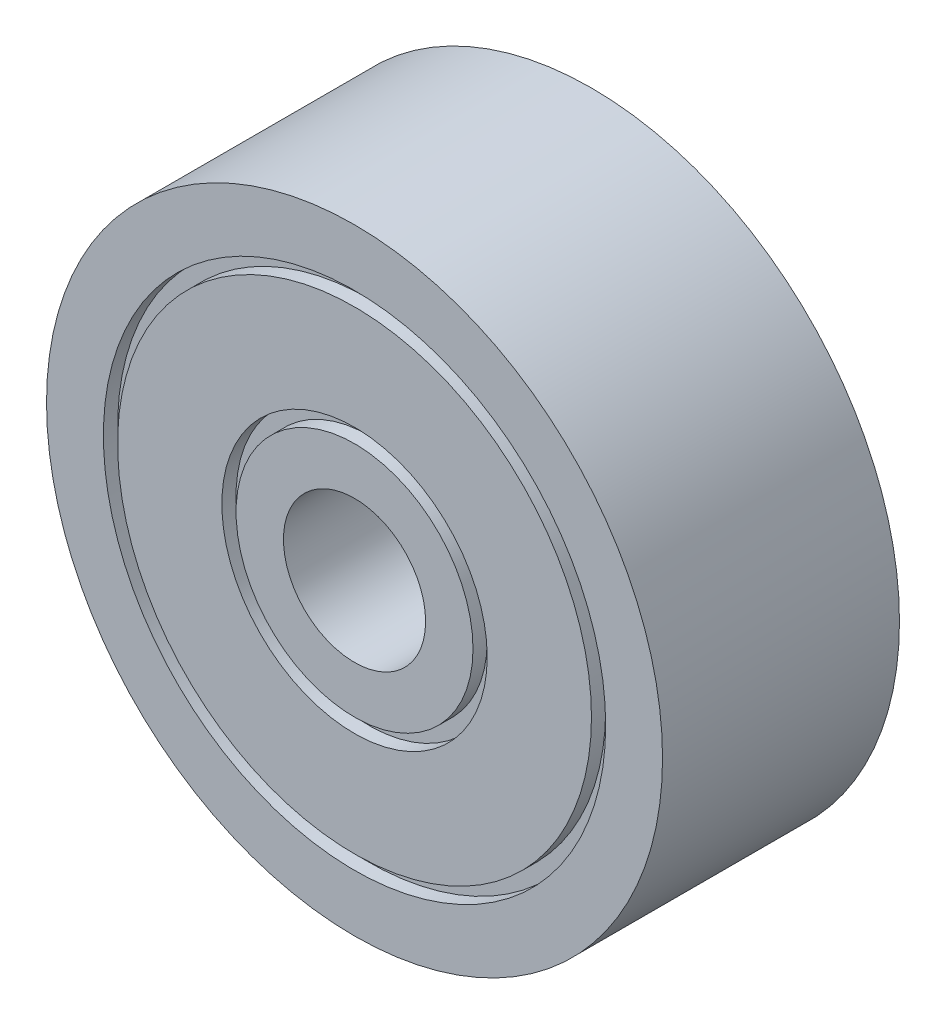
ISO-10303-21;
HEADER;
FILE_DESCRIPTION(('STEP AP214'),'2;1');
FILE_NAME('part.step','',(''),(''),'','','');
FILE_SCHEMA(('AUTOMOTIVE_DESIGN { 1 0 10303 214 1 1 1 1 }'));
ENDSEC;
DATA;
#1=APPLICATION_CONTEXT('core data for automotive mechanical design processes');
#2=APPLICATION_PROTOCOL_DEFINITION('international standard','automotive_design',2000,#1);
#3=PRODUCT_CONTEXT('',#1,'mechanical');
#4=PRODUCT('Part','Part','',(#3));
#5=PRODUCT_RELATED_PRODUCT_CATEGORY('part','',(#4));
#6=PRODUCT_DEFINITION_FORMATION('','',#4);
#7=PRODUCT_DEFINITION_CONTEXT('part definition',#1,'design');
#8=PRODUCT_DEFINITION('design','',#6,#7);
#9=PRODUCT_DEFINITION_SHAPE('','',#8);
#10=(LENGTH_UNIT() NAMED_UNIT(*) SI_UNIT(.MILLI.,.METRE.));
#11=(NAMED_UNIT(*) PLANE_ANGLE_UNIT() SI_UNIT($,.RADIAN.));
#12=(NAMED_UNIT(*) SI_UNIT($,.STERADIAN.) SOLID_ANGLE_UNIT());
#13=UNCERTAINTY_MEASURE_WITH_UNIT(LENGTH_MEASURE(1.E-05),#10,'distance_accuracy_value','');
#14=(GEOMETRIC_REPRESENTATION_CONTEXT(3) GLOBAL_UNCERTAINTY_ASSIGNED_CONTEXT((#13)) GLOBAL_UNIT_ASSIGNED_CONTEXT((#10,
#11,#12)) REPRESENTATION_CONTEXT('',''));
#15=CARTESIAN_POINT('',(0.,0.,0.));
#16=DIRECTION('',(0.,0.,1.));
#17=DIRECTION('',(1.,0.,0.));
#18=AXIS2_PLACEMENT_3D('',#15,#16,#17);
#19=CARTESIAN_POINT('',(0.,0.,5.));
#20=DIRECTION('',(0.,0.,1.));
#21=DIRECTION('',(1.,0.,0.));
#22=AXIS2_PLACEMENT_3D('',#19,#20,#21);
#23=PLANE('',#22);
#24=CARTESIAN_POINT('',(0.,0.,5.));
#25=DIRECTION('',(0.,0.,1.));
#26=DIRECTION('',(1.,0.,0.));
#27=AXIS2_PLACEMENT_3D('',#24,#25,#26);
#28=CIRCLE('',#27,2.8);
#29=CARTESIAN_POINT('',(2.8,0.,5.));
#30=VERTEX_POINT('',#29);
#31=EDGE_CURVE('E57',#30,#30,#28,.T.);
#32=ORIENTED_EDGE('',*,*,#31,.F.);
#33=EDGE_LOOP('',(#32));
#34=FACE_BOUND('',#33,.T.);
#35=CARTESIAN_POINT('',(0.,0.,5.));
#36=DIRECTION('',(0.,0.,1.));
#37=DIRECTION('',(1.,0.,0.));
#38=AXIS2_PLACEMENT_3D('',#35,#36,#37);
#39=CIRCLE('',#38,5.);
#40=CARTESIAN_POINT('',(5.,0.,5.));
#41=VERTEX_POINT('',#40);
#42=EDGE_CURVE('E91',#41,#41,#39,.T.);
#43=ORIENTED_EDGE('',*,*,#42,.T.);
#44=EDGE_LOOP('',(#43));
#45=FACE_BOUND('',#44,.T.);
#46=ADVANCED_FACE('F30',(#34,#45),#23,.T.);
#47=CARTESIAN_POINT('',(0.,0.,0.));
#48=DIRECTION('',(0.,0.,1.));
#49=DIRECTION('',(1.,0.,0.));
#50=AXIS2_PLACEMENT_3D('',#47,#48,#49);
#51=PLANE('',#50);
#52=CARTESIAN_POINT('',(0.,0.,0.));
#53=DIRECTION('',(0.,0.,1.));
#54=DIRECTION('',(1.,0.,0.));
#55=AXIS2_PLACEMENT_3D('',#52,#53,#54);
#56=CIRCLE('',#55,2.5);
#57=CARTESIAN_POINT('',(2.5,0.,0.));
#58=VERTEX_POINT('',#57);
#59=EDGE_CURVE('E63',#58,#58,#56,.T.);
#60=ORIENTED_EDGE('',*,*,#59,.F.);
#61=EDGE_LOOP('',(#60));
#62=FACE_BOUND('',#61,.T.);
#63=CARTESIAN_POINT('',(0.,0.,0.));
#64=DIRECTION('',(0.,0.,1.));
#65=DIRECTION('',(1.,0.,0.));
#66=AXIS2_PLACEMENT_3D('',#63,#64,#65);
#67=CIRCLE('',#66,1.5);
#68=CARTESIAN_POINT('',(1.5,0.,0.));
#69=VERTEX_POINT('',#68);
#70=EDGE_CURVE('E43',#69,#69,#67,.T.);
#71=ORIENTED_EDGE('',*,*,#70,.T.);
#72=EDGE_LOOP('',(#71));
#73=FACE_BOUND('',#72,.T.);
#74=ADVANCED_FACE('F117',(#62,#73),#51,.F.);
#75=CARTESIAN_POINT('',(0.,0.,5.));
#76=DIRECTION('',(0.,0.,1.));
#77=DIRECTION('',(1.,0.,0.));
#78=AXIS2_PLACEMENT_3D('',#75,#76,#77);
#79=CIRCLE('',#78,2.5);
#80=CARTESIAN_POINT('',(2.5,0.,5.));
#81=VERTEX_POINT('',#80);
#82=EDGE_CURVE('E46',#81,#81,#79,.T.);
#83=ORIENTED_EDGE('',*,*,#82,.T.);
#84=EDGE_LOOP('',(#83));
#85=FACE_BOUND('',#84,.T.);
#86=CARTESIAN_POINT('',(0.,0.,5.));
#87=DIRECTION('',(0.,0.,1.));
#88=DIRECTION('',(1.,0.,0.));
#89=AXIS2_PLACEMENT_3D('',#86,#87,#88);
#90=CIRCLE('',#89,1.5);
#91=CARTESIAN_POINT('',(1.5,0.,5.));
#92=VERTEX_POINT('',#91);
#93=EDGE_CURVE('E41',#92,#92,#90,.T.);
#94=ORIENTED_EDGE('',*,*,#93,.F.);
#95=EDGE_LOOP('',(#94));
#96=FACE_BOUND('',#95,.T.);
#97=ADVANCED_FACE('F120',(#85,#96),#23,.T.);
#98=CARTESIAN_POINT('',(0.,0.,5.));
#99=DIRECTION('',(0.,0.,-1.));
#100=DIRECTION('',(-1.,0.,0.));
#101=AXIS2_PLACEMENT_3D('',#98,#99,#100);
#102=CYLINDRICAL_SURFACE('',#101,1.5);
#103=ORIENTED_EDGE('',*,*,#93,.T.);
#104=EDGE_LOOP('',(#103));
#105=FACE_BOUND('',#104,.T.);
#106=ORIENTED_EDGE('',*,*,#70,.F.);
#107=EDGE_LOOP('',(#106));
#108=FACE_BOUND('',#107,.T.);
#109=ADVANCED_FACE('F132',(#105,#108),#102,.F.);
#110=CARTESIAN_POINT('',(0.,0.,5.25));
#111=DIRECTION('',(0.,0.,1.));
#112=DIRECTION('',(1.,0.,0.));
#113=AXIS2_PLACEMENT_3D('',#110,#111,#112);
#114=CYLINDRICAL_SURFACE('',#113,2.5);
#115=CARTESIAN_POINT('',(0.,0.,4.7));
#116=DIRECTION('',(0.,0.,1.));
#117=DIRECTION('',(1.,0.,0.));
#118=AXIS2_PLACEMENT_3D('',#115,#116,#117);
#119=CIRCLE('',#118,2.5);
#120=CARTESIAN_POINT('',(2.5,0.,4.7));
#121=VERTEX_POINT('',#120);
#122=EDGE_CURVE('E51',#121,#121,#119,.T.);
#123=ORIENTED_EDGE('',*,*,#122,.T.);
#124=EDGE_LOOP('',(#123));
#125=FACE_BOUND('',#124,.T.);
#126=ORIENTED_EDGE('',*,*,#82,.F.);
#127=EDGE_LOOP('',(#126));
#128=FACE_BOUND('',#127,.T.);
#129=ADVANCED_FACE('F172',(#125,#128),#114,.T.);
#130=CARTESIAN_POINT('',(0.,2.8,4.7));
#131=DIRECTION('',(0.,0.,1.));
#132=DIRECTION('',(1.,0.,0.));
#133=AXIS2_PLACEMENT_3D('',#130,#131,#132);
#134=PLANE('',#133);
#135=CARTESIAN_POINT('',(0.,0.,4.7));
#136=DIRECTION('',(0.,0.,1.));
#137=DIRECTION('',(1.,0.,0.));
#138=AXIS2_PLACEMENT_3D('',#135,#136,#137);
#139=CIRCLE('',#138,2.8);
#140=CARTESIAN_POINT('',(2.8,0.,4.7));
#141=VERTEX_POINT('',#140);
#142=EDGE_CURVE('E54',#141,#141,#139,.T.);
#143=ORIENTED_EDGE('',*,*,#142,.T.);
#144=EDGE_LOOP('',(#143));
#145=FACE_BOUND('',#144,.T.);
#146=ORIENTED_EDGE('',*,*,#122,.F.);
#147=EDGE_LOOP('',(#146));
#148=FACE_BOUND('',#147,.T.);
#149=ADVANCED_FACE('F168',(#145,#148),#134,.T.);
#150=CARTESIAN_POINT('',(0.,0.,5.25));
#151=DIRECTION('',(0.,0.,1.));
#152=DIRECTION('',(1.,0.,0.));
#153=AXIS2_PLACEMENT_3D('',#150,#151,#152);
#154=CYLINDRICAL_SURFACE('',#153,2.8);
#155=ORIENTED_EDGE('',*,*,#31,.T.);
#156=EDGE_LOOP('',(#155));
#157=FACE_BOUND('',#156,.T.);
#158=ORIENTED_EDGE('',*,*,#142,.F.);
#159=EDGE_LOOP('',(#158));
#160=FACE_BOUND('',#159,.T.);
#161=ADVANCED_FACE('F164',(#157,#160),#154,.F.);
#162=CARTESIAN_POINT('',(0.,2.8,0.3));
#163=DIRECTION('',(0.,0.,-1.));
#164=DIRECTION('',(-1.,0.,0.));
#165=AXIS2_PLACEMENT_3D('',#162,#163,#164);
#166=PLANE('',#165);
#167=CARTESIAN_POINT('',(0.,0.,0.3));
#168=DIRECTION('',(0.,0.,1.));
#169=DIRECTION('',(1.,0.,0.));
#170=AXIS2_PLACEMENT_3D('',#167,#168,#169);
#171=CIRCLE('',#170,2.5);
#172=CARTESIAN_POINT('',(2.5,0.,0.3));
#173=VERTEX_POINT('',#172);
#174=EDGE_CURVE('E60',#173,#173,#171,.T.);
#175=ORIENTED_EDGE('',*,*,#174,.T.);
#176=EDGE_LOOP('',(#175));
#177=FACE_BOUND('',#176,.T.);
#178=CARTESIAN_POINT('',(0.,0.,0.3));
#179=DIRECTION('',(0.,0.,1.));
#180=DIRECTION('',(1.,0.,0.));
#181=AXIS2_PLACEMENT_3D('',#178,#179,#180);
#182=CIRCLE('',#181,2.8);
#183=CARTESIAN_POINT('',(2.8,0.,0.3));
#184=VERTEX_POINT('',#183);
#185=EDGE_CURVE('E69',#184,#184,#182,.T.);
#186=ORIENTED_EDGE('',*,*,#185,.F.);
#187=EDGE_LOOP('',(#186));
#188=FACE_BOUND('',#187,.T.);
#189=ADVANCED_FACE('F160',(#177,#188),#166,.T.);
#190=CARTESIAN_POINT('',(0.,0.,5.25));
#191=DIRECTION('',(0.,0.,1.));
#192=DIRECTION('',(1.,0.,0.));
#193=AXIS2_PLACEMENT_3D('',#190,#191,#192);
#194=CYLINDRICAL_SURFACE('',#193,2.5);
#195=ORIENTED_EDGE('',*,*,#59,.T.);
#196=EDGE_LOOP('',(#195));
#197=FACE_BOUND('',#196,.T.);
#198=ORIENTED_EDGE('',*,*,#174,.F.);
#199=EDGE_LOOP('',(#198));
#200=FACE_BOUND('',#199,.T.);
#201=ADVANCED_FACE('F112',(#197,#200),#194,.T.);
#202=CARTESIAN_POINT('',(0.,0.,5.25));
#203=DIRECTION('',(0.,0.,1.));
#204=DIRECTION('',(1.,0.,0.));
#205=AXIS2_PLACEMENT_3D('',#202,#203,#204);
#206=CYLINDRICAL_SURFACE('',#205,2.8);
#207=ORIENTED_EDGE('',*,*,#185,.T.);
#208=EDGE_LOOP('',(#207));
#209=FACE_BOUND('',#208,.T.);
#210=CARTESIAN_POINT('',(0.,0.,0.));
#211=DIRECTION('',(0.,0.,1.));
#212=DIRECTION('',(1.,0.,0.));
#213=AXIS2_PLACEMENT_3D('',#210,#211,#212);
#214=CIRCLE('',#213,2.8);
#215=CARTESIAN_POINT('',(2.8,0.,0.));
#216=VERTEX_POINT('',#215);
#217=EDGE_CURVE('E66',#216,#216,#214,.T.);
#218=ORIENTED_EDGE('',*,*,#217,.F.);
#219=EDGE_LOOP('',(#218));
#220=FACE_BOUND('',#219,.T.);
#221=ADVANCED_FACE('F103',(#209,#220),#206,.F.);
#222=CARTESIAN_POINT('',(0.,5.,4.7));
#223=DIRECTION('',(0.,0.,1.));
#224=DIRECTION('',(1.,0.,0.));
#225=AXIS2_PLACEMENT_3D('',#222,#223,#224);
#226=PLANE('',#225);
#227=CARTESIAN_POINT('',(0.,0.,4.7));
#228=DIRECTION('',(0.,0.,1.));
#229=DIRECTION('',(1.,0.,0.));
#230=AXIS2_PLACEMENT_3D('',#227,#228,#229);
#231=CIRCLE('',#230,5.3);
#232=CARTESIAN_POINT('',(5.3,0.,4.7));
#233=VERTEX_POINT('',#232);
#234=EDGE_CURVE('E72',#233,#233,#231,.T.);
#235=ORIENTED_EDGE('',*,*,#234,.T.);
#236=EDGE_LOOP('',(#235));
#237=FACE_BOUND('',#236,.T.);
#238=CARTESIAN_POINT('',(0.,0.,4.7));
#239=DIRECTION('',(0.,0.,1.));
#240=DIRECTION('',(1.,0.,0.));
#241=AXIS2_PLACEMENT_3D('',#238,#239,#240);
#242=CIRCLE('',#241,5.);
#243=CARTESIAN_POINT('',(5.,0.,4.7));
#244=VERTEX_POINT('',#243);
#245=EDGE_CURVE('E76',#244,#244,#242,.T.);
#246=ORIENTED_EDGE('',*,*,#245,.F.);
#247=EDGE_LOOP('',(#246));
#248=FACE_BOUND('',#247,.T.);
#249=ADVANCED_FACE('F100',(#237,#248),#226,.T.);
#250=CARTESIAN_POINT('',(0.,0.,5.25));
#251=DIRECTION('',(0.,0.,1.));
#252=DIRECTION('',(1.,0.,0.));
#253=AXIS2_PLACEMENT_3D('',#250,#251,#252);
#254=CYLINDRICAL_SURFACE('',#253,5.3);
#255=CARTESIAN_POINT('',(0.,0.,5.));
#256=DIRECTION('',(0.,0.,1.));
#257=DIRECTION('',(1.,0.,0.));
#258=AXIS2_PLACEMENT_3D('',#255,#256,#257);
#259=CIRCLE('',#258,5.3);
#260=CARTESIAN_POINT('',(5.3,0.,5.));
#261=VERTEX_POINT('',#260);
#262=EDGE_CURVE('E88',#261,#261,#259,.T.);
#263=ORIENTED_EDGE('',*,*,#262,.T.);
#264=EDGE_LOOP('',(#263));
#265=FACE_BOUND('',#264,.T.);
#266=ORIENTED_EDGE('',*,*,#234,.F.);
#267=EDGE_LOOP('',(#266));
#268=FACE_BOUND('',#267,.T.);
#269=ADVANCED_FACE('F102',(#265,#268),#254,.F.);
#270=CARTESIAN_POINT('',(0.,0.,5.25));
#271=DIRECTION('',(0.,0.,1.));
#272=DIRECTION('',(1.,0.,0.));
#273=AXIS2_PLACEMENT_3D('',#270,#271,#272);
#274=CYLINDRICAL_SURFACE('',#273,5.);
#275=ORIENTED_EDGE('',*,*,#245,.T.);
#276=EDGE_LOOP('',(#275));
#277=FACE_BOUND('',#276,.T.);
#278=ORIENTED_EDGE('',*,*,#42,.F.);
#279=EDGE_LOOP('',(#278));
#280=FACE_BOUND('',#279,.T.);
#281=ADVANCED_FACE('F97',(#277,#280),#274,.T.);
#282=CARTESIAN_POINT('',(0.,0.,0.));
#283=DIRECTION('',(0.,0.,1.));
#284=DIRECTION('',(1.,0.,0.));
#285=AXIS2_PLACEMENT_3D('',#282,#283,#284);
#286=CIRCLE('',#285,5.);
#287=CARTESIAN_POINT('',(5.,0.,0.));
#288=VERTEX_POINT('',#287);
#289=EDGE_CURVE('E80',#288,#288,#286,.T.);
#290=ORIENTED_EDGE('',*,*,#289,.F.);
#291=EDGE_LOOP('',(#290));
#292=FACE_BOUND('',#291,.T.);
#293=ORIENTED_EDGE('',*,*,#217,.T.);
#294=EDGE_LOOP('',(#293));
#295=FACE_BOUND('',#294,.T.);
#296=ADVANCED_FACE('F126',(#292,#295),#51,.F.);
#297=CARTESIAN_POINT('',(0.,5.,0.3));
#298=DIRECTION('',(0.,0.,-1.));
#299=DIRECTION('',(-1.,0.,0.));
#300=AXIS2_PLACEMENT_3D('',#297,#298,#299);
#301=PLANE('',#300);
#302=CARTESIAN_POINT('',(0.,0.,0.3));
#303=DIRECTION('',(0.,0.,1.));
#304=DIRECTION('',(1.,0.,0.));
#305=AXIS2_PLACEMENT_3D('',#302,#303,#304);
#306=CIRCLE('',#305,5.);
#307=CARTESIAN_POINT('',(5.,0.,0.3));
#308=VERTEX_POINT('',#307);
#309=EDGE_CURVE('E83',#308,#308,#306,.T.);
#310=ORIENTED_EDGE('',*,*,#309,.T.);
#311=EDGE_LOOP('',(#310));
#312=FACE_BOUND('',#311,.T.);
#313=CARTESIAN_POINT('',(0.,0.,0.3));
#314=DIRECTION('',(0.,0.,1.));
#315=DIRECTION('',(1.,0.,0.));
#316=AXIS2_PLACEMENT_3D('',#313,#314,#315);
#317=CIRCLE('',#316,5.3);
#318=CARTESIAN_POINT('',(5.3,0.,0.3));
#319=VERTEX_POINT('',#318);
#320=EDGE_CURVE('E73',#319,#319,#317,.T.);
#321=ORIENTED_EDGE('',*,*,#320,.F.);
#322=EDGE_LOOP('',(#321));
#323=FACE_BOUND('',#322,.T.);
#324=ADVANCED_FACE('F150',(#312,#323),#301,.T.);
#325=CARTESIAN_POINT('',(0.,0.,5.25));
#326=DIRECTION('',(0.,0.,1.));
#327=DIRECTION('',(1.,0.,0.));
#328=AXIS2_PLACEMENT_3D('',#325,#326,#327);
#329=CYLINDRICAL_SURFACE('',#328,5.3);
#330=ORIENTED_EDGE('',*,*,#320,.T.);
#331=EDGE_LOOP('',(#330));
#332=FACE_BOUND('',#331,.T.);
#333=CARTESIAN_POINT('',(0.,0.,0.));
#334=DIRECTION('',(0.,0.,1.));
#335=DIRECTION('',(1.,0.,0.));
#336=AXIS2_PLACEMENT_3D('',#333,#334,#335);
#337=CIRCLE('',#336,5.3);
#338=CARTESIAN_POINT('',(5.3,0.,0.));
#339=VERTEX_POINT('',#338);
#340=EDGE_CURVE('E77',#339,#339,#337,.T.);
#341=ORIENTED_EDGE('',*,*,#340,.F.);
#342=EDGE_LOOP('',(#341));
#343=FACE_BOUND('',#342,.T.);
#344=ADVANCED_FACE('F141',(#332,#343),#329,.F.);
#345=CARTESIAN_POINT('',(0.,0.,5.25));
#346=DIRECTION('',(0.,0.,1.));
#347=DIRECTION('',(1.,0.,0.));
#348=AXIS2_PLACEMENT_3D('',#345,#346,#347);
#349=CYLINDRICAL_SURFACE('',#348,5.);
#350=ORIENTED_EDGE('',*,*,#289,.T.);
#351=EDGE_LOOP('',(#350));
#352=FACE_BOUND('',#351,.T.);
#353=ORIENTED_EDGE('',*,*,#309,.F.);
#354=EDGE_LOOP('',(#353));
#355=FACE_BOUND('',#354,.T.);
#356=ADVANCED_FACE('F135',(#352,#355),#349,.T.);
#357=CARTESIAN_POINT('',(0.,0.,5.));
#358=DIRECTION('',(0.,0.,1.));
#359=DIRECTION('',(1.,0.,0.));
#360=AXIS2_PLACEMENT_3D('',#357,#358,#359);
#361=CIRCLE('',#360,6.50000000000001);
#362=CARTESIAN_POINT('',(6.50000000000001,0.,5.));
#363=VERTEX_POINT('',#362);
#364=EDGE_CURVE('E10',#363,#363,#361,.T.);
#365=ORIENTED_EDGE('',*,*,#364,.T.);
#366=EDGE_LOOP('',(#365));
#367=FACE_BOUND('',#366,.T.);
#368=ORIENTED_EDGE('',*,*,#262,.F.);
#369=EDGE_LOOP('',(#368));
#370=FACE_BOUND('',#369,.T.);
#371=ADVANCED_FACE('F121',(#367,#370),#23,.T.);
#372=CARTESIAN_POINT('',(0.,0.,5.));
#373=DIRECTION('',(0.,0.,-1.));
#374=DIRECTION('',(-1.,0.,0.));
#375=AXIS2_PLACEMENT_3D('',#372,#373,#374);
#376=CYLINDRICAL_SURFACE('',#375,6.50000000000001);
#377=ORIENTED_EDGE('',*,*,#364,.F.);
#378=EDGE_LOOP('',(#377));
#379=FACE_BOUND('',#378,.T.);
#380=CARTESIAN_POINT('',(0.,0.,0.));
#381=DIRECTION('',(0.,0.,1.));
#382=DIRECTION('',(1.,0.,0.));
#383=AXIS2_PLACEMENT_3D('',#380,#381,#382);
#384=CIRCLE('',#383,6.50000000000001);
#385=CARTESIAN_POINT('',(6.50000000000001,0.,0.));
#386=VERTEX_POINT('',#385);
#387=EDGE_CURVE('E34',#386,#386,#384,.T.);
#388=ORIENTED_EDGE('',*,*,#387,.T.);
#389=EDGE_LOOP('',(#388));
#390=FACE_BOUND('',#389,.T.);
#391=ADVANCED_FACE('F32',(#379,#390),#376,.T.);
#392=ORIENTED_EDGE('',*,*,#340,.T.);
#393=EDGE_LOOP('',(#392));
#394=FACE_BOUND('',#393,.T.);
#395=ORIENTED_EDGE('',*,*,#387,.F.);
#396=EDGE_LOOP('',(#395));
#397=FACE_BOUND('',#396,.T.);
#398=ADVANCED_FACE('F127',(#394,#397),#51,.F.);
#399=CLOSED_SHELL('',(#46,#74,#97,#109,#129,#149,#161,#189,#201,#221,#249,#269,#281,#296,#324,
#344,#356,#371,#391,#398));
#400=MANIFOLD_SOLID_BREP('B2',#399);
#401=ADVANCED_BREP_SHAPE_REPRESENTATION('',(#18,#400),#14);
#402=SHAPE_DEFINITION_REPRESENTATION(#9,#401);
ENDSEC;
END-ISO-10303-21;
